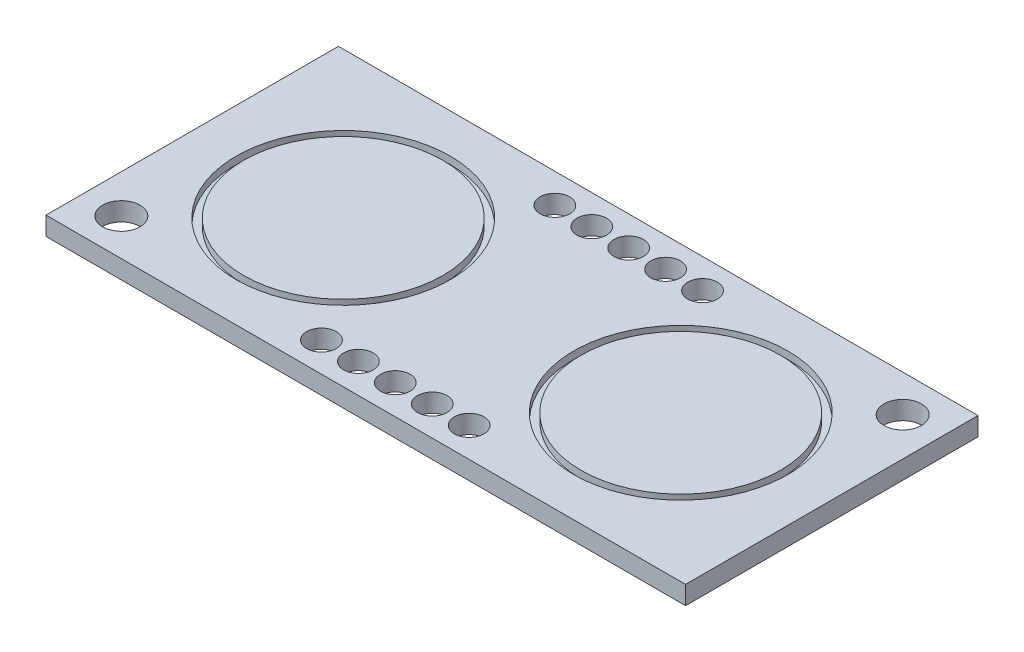
ISO-10303-21;
HEADER;
FILE_DESCRIPTION(('STEP AP214'),'2;1');
FILE_NAME('part.step','',(''),(''),'','','');
FILE_SCHEMA(('AUTOMOTIVE_DESIGN { 1 0 10303 214 1 1 1 1 }'));
ENDSEC;
DATA;
#1=APPLICATION_CONTEXT('core data for automotive mechanical design processes');
#2=APPLICATION_PROTOCOL_DEFINITION('international standard','automotive_design',2000,#1);
#3=PRODUCT_CONTEXT('',#1,'mechanical');
#4=PRODUCT('Part','Part','',(#3));
#5=PRODUCT_RELATED_PRODUCT_CATEGORY('part','',(#4));
#6=PRODUCT_DEFINITION_FORMATION('','',#4);
#7=PRODUCT_DEFINITION_CONTEXT('part definition',#1,'design');
#8=PRODUCT_DEFINITION('design','',#6,#7);
#9=PRODUCT_DEFINITION_SHAPE('','',#8);
#10=(LENGTH_UNIT() NAMED_UNIT(*) SI_UNIT(.MILLI.,.METRE.));
#11=(NAMED_UNIT(*) PLANE_ANGLE_UNIT() SI_UNIT($,.RADIAN.));
#12=(NAMED_UNIT(*) SI_UNIT($,.STERADIAN.) SOLID_ANGLE_UNIT());
#13=UNCERTAINTY_MEASURE_WITH_UNIT(LENGTH_MEASURE(1.E-05),#10,'distance_accuracy_value','');
#14=(GEOMETRIC_REPRESENTATION_CONTEXT(3) GLOBAL_UNCERTAINTY_ASSIGNED_CONTEXT((#13)) GLOBAL_UNIT_ASSIGNED_CONTEXT((#10,
#11,#12)) REPRESENTATION_CONTEXT('',''));
#15=CARTESIAN_POINT('',(0.,0.,0.));
#16=DIRECTION('',(0.,0.,1.));
#17=DIRECTION('',(1.,0.,0.));
#18=AXIS2_PLACEMENT_3D('',#15,#16,#17);
#19=CARTESIAN_POINT('',(-21.65,1.25,9.9));
#20=DIRECTION('',(0.,1.,0.));
#21=DIRECTION('',(0.,0.,1.));
#22=AXIS2_PLACEMENT_3D('',#19,#20,#21);
#23=PLANE('',#22);
#24=CARTESIAN_POINT('',(11.425,1.25,0.));
#25=DIRECTION('',(0.,1.,0.));
#26=DIRECTION('',(0.,0.,1.));
#27=AXIS2_PLACEMENT_3D('',#24,#25,#26);
#28=CIRCLE('',#27,7.25);
#29=CARTESIAN_POINT('',(11.425,1.25,7.25));
#30=VERTEX_POINT('',#29);
#31=EDGE_CURVE('E196',#30,#30,#28,.T.);
#32=ORIENTED_EDGE('',*,*,#31,.F.);
#33=EDGE_LOOP('',(#32));
#34=FACE_BOUND('',#33,.T.);
#35=CARTESIAN_POINT('',(-11.425,1.25,0.));
#36=DIRECTION('',(0.,1.,0.));
#37=DIRECTION('',(0.,0.,1.));
#38=AXIS2_PLACEMENT_3D('',#35,#36,#37);
#39=CIRCLE('',#38,7.25);
#40=CARTESIAN_POINT('',(-11.425,1.25,7.25));
#41=VERTEX_POINT('',#40);
#42=EDGE_CURVE('E184',#41,#41,#39,.T.);
#43=ORIENTED_EDGE('',*,*,#42,.F.);
#44=EDGE_LOOP('',(#43));
#45=FACE_BOUND('',#44,.T.);
#46=CARTESIAN_POINT('',(2.5,1.25,7.9));
#47=DIRECTION('',(0.,1.,0.));
#48=DIRECTION('',(0.,0.,1.));
#49=AXIS2_PLACEMENT_3D('',#46,#47,#48);
#50=CIRCLE('',#49,1.);
#51=CARTESIAN_POINT('',(2.5,1.25,8.9));
#52=VERTEX_POINT('',#51);
#53=EDGE_CURVE('E169',#52,#52,#50,.T.);
#54=ORIENTED_EDGE('',*,*,#53,.F.);
#55=EDGE_LOOP('',(#54));
#56=FACE_BOUND('',#55,.T.);
#57=CARTESIAN_POINT('',(-5.,1.25,7.9));
#58=DIRECTION('',(0.,1.,0.));
#59=DIRECTION('',(0.,0.,1.));
#60=AXIS2_PLACEMENT_3D('',#57,#58,#59);
#61=CIRCLE('',#60,1.);
#62=CARTESIAN_POINT('',(-5.,1.25,8.9));
#63=VERTEX_POINT('',#62);
#64=EDGE_CURVE('E157',#63,#63,#61,.T.);
#65=ORIENTED_EDGE('',*,*,#64,.F.);
#66=EDGE_LOOP('',(#65));
#67=FACE_BOUND('',#66,.T.);
#68=CARTESIAN_POINT('',(-2.5,1.25,-7.9));
#69=DIRECTION('',(0.,1.,0.));
#70=DIRECTION('',(0.,0.,1.));
#71=AXIS2_PLACEMENT_3D('',#68,#69,#70);
#72=CIRCLE('',#71,1.);
#73=CARTESIAN_POINT('',(-2.5,1.25,-6.9));
#74=VERTEX_POINT('',#73);
#75=EDGE_CURVE('E145',#74,#74,#72,.T.);
#76=ORIENTED_EDGE('',*,*,#75,.F.);
#77=EDGE_LOOP('',(#76));
#78=FACE_BOUND('',#77,.T.);
#79=CARTESIAN_POINT('',(2.5,1.25,-7.9));
#80=DIRECTION('',(0.,1.,0.));
#81=DIRECTION('',(0.,0.,1.));
#82=AXIS2_PLACEMENT_3D('',#79,#80,#81);
#83=CIRCLE('',#82,1.);
#84=CARTESIAN_POINT('',(2.5,1.25,-6.9));
#85=VERTEX_POINT('',#84);
#86=EDGE_CURVE('E133',#85,#85,#83,.T.);
#87=ORIENTED_EDGE('',*,*,#86,.F.);
#88=EDGE_LOOP('',(#87));
#89=FACE_BOUND('',#88,.T.);
#90=CARTESIAN_POINT('',(0.,1.25,7.9));
#91=DIRECTION('',(0.,1.,0.));
#92=DIRECTION('',(0.,0.,1.));
#93=AXIS2_PLACEMENT_3D('',#90,#91,#92);
#94=CIRCLE('',#93,1.);
#95=CARTESIAN_POINT('',(0.,1.25,8.9));
#96=VERTEX_POINT('',#95);
#97=EDGE_CURVE('E121',#96,#96,#94,.T.);
#98=ORIENTED_EDGE('',*,*,#97,.F.);
#99=EDGE_LOOP('',(#98));
#100=FACE_BOUND('',#99,.T.);
#101=CARTESIAN_POINT('',(-19.05,1.25,7.4));
#102=DIRECTION('',(0.,1.,0.));
#103=DIRECTION('',(0.,0.,1.));
#104=AXIS2_PLACEMENT_3D('',#101,#102,#103);
#105=CIRCLE('',#104,1.27);
#106=CARTESIAN_POINT('',(-19.05,1.25,8.67));
#107=VERTEX_POINT('',#106);
#108=EDGE_CURVE('E100',#107,#107,#105,.T.);
#109=ORIENTED_EDGE('',*,*,#108,.F.);
#110=EDGE_LOOP('',(#109));
#111=FACE_BOUND('',#110,.T.);
#112=DIRECTION('',(0.,0.,1.));
#113=VECTOR('',#112,1.);
#114=CARTESIAN_POINT('',(-21.65,1.25,-9.9));
#115=LINE('',#114,#113);
#116=CARTESIAN_POINT('',(-21.65,1.25,-9.9));
#117=VERTEX_POINT('',#116);
#118=CARTESIAN_POINT('',(-21.65,1.25,9.9));
#119=VERTEX_POINT('',#118);
#120=EDGE_CURVE('E85',#117,#119,#115,.T.);
#121=ORIENTED_EDGE('',*,*,#120,.T.);
#122=DIRECTION('',(1.,0.,0.));
#123=VECTOR('',#122,1.);
#124=CARTESIAN_POINT('',(-21.65,1.25,9.9));
#125=LINE('',#124,#123);
#126=CARTESIAN_POINT('',(21.65,1.25,9.9));
#127=VERTEX_POINT('',#126);
#128=EDGE_CURVE('E80',#119,#127,#125,.T.);
#129=ORIENTED_EDGE('',*,*,#128,.T.);
#130=DIRECTION('',(0.,0.,-1.));
#131=VECTOR('',#130,1.);
#132=CARTESIAN_POINT('',(21.65,1.25,-9.9));
#133=LINE('',#132,#131);
#134=CARTESIAN_POINT('',(21.65,1.25,-9.9));
#135=VERTEX_POINT('',#134);
#136=EDGE_CURVE('E83',#127,#135,#133,.T.);
#137=ORIENTED_EDGE('',*,*,#136,.T.);
#138=DIRECTION('',(-1.,0.,0.));
#139=VECTOR('',#138,1.);
#140=CARTESIAN_POINT('',(-21.65,1.25,-9.9));
#141=LINE('',#140,#139);
#142=EDGE_CURVE('E50',#135,#117,#141,.T.);
#143=ORIENTED_EDGE('',*,*,#142,.T.);
#144=EDGE_LOOP('',(#121,#129,#137,#143));
#145=FACE_BOUND('',#144,.T.);
#146=CARTESIAN_POINT('',(19.05,1.25,-7.40000000000009));
#147=DIRECTION('',(0.,1.,0.));
#148=DIRECTION('',(0.,0.,1.));
#149=AXIS2_PLACEMENT_3D('',#146,#147,#148);
#150=CIRCLE('',#149,1.26999999999997);
#151=CARTESIAN_POINT('',(19.05,1.25,-6.13000000000013));
#152=VERTEX_POINT('',#151);
#153=EDGE_CURVE('E115',#152,#152,#150,.T.);
#154=ORIENTED_EDGE('',*,*,#153,.F.);
#155=EDGE_LOOP('',(#154));
#156=FACE_BOUND('',#155,.T.);
#157=CARTESIAN_POINT('',(0.,1.25,-7.9));
#158=DIRECTION('',(0.,1.,0.));
#159=DIRECTION('',(0.,0.,1.));
#160=AXIS2_PLACEMENT_3D('',#157,#158,#159);
#161=CIRCLE('',#160,1.);
#162=CARTESIAN_POINT('',(0.,1.25,-6.9));
#163=VERTEX_POINT('',#162);
#164=EDGE_CURVE('E127',#163,#163,#161,.T.);
#165=ORIENTED_EDGE('',*,*,#164,.F.);
#166=EDGE_LOOP('',(#165));
#167=FACE_BOUND('',#166,.T.);
#168=CARTESIAN_POINT('',(5.,1.25,-7.9));
#169=DIRECTION('',(0.,1.,0.));
#170=DIRECTION('',(0.,0.,1.));
#171=AXIS2_PLACEMENT_3D('',#168,#169,#170);
#172=CIRCLE('',#171,1.);
#173=CARTESIAN_POINT('',(5.,1.25,-6.9));
#174=VERTEX_POINT('',#173);
#175=EDGE_CURVE('E139',#174,#174,#172,.T.);
#176=ORIENTED_EDGE('',*,*,#175,.F.);
#177=EDGE_LOOP('',(#176));
#178=FACE_BOUND('',#177,.T.);
#179=CARTESIAN_POINT('',(-5.,1.25,-7.9));
#180=DIRECTION('',(0.,1.,0.));
#181=DIRECTION('',(0.,0.,1.));
#182=AXIS2_PLACEMENT_3D('',#179,#180,#181);
#183=CIRCLE('',#182,1.);
#184=CARTESIAN_POINT('',(-5.,1.25,-6.9));
#185=VERTEX_POINT('',#184);
#186=EDGE_CURVE('E151',#185,#185,#183,.T.);
#187=ORIENTED_EDGE('',*,*,#186,.F.);
#188=EDGE_LOOP('',(#187));
#189=FACE_BOUND('',#188,.T.);
#190=CARTESIAN_POINT('',(-2.5,1.25,7.9));
#191=DIRECTION('',(0.,1.,0.));
#192=DIRECTION('',(0.,0.,1.));
#193=AXIS2_PLACEMENT_3D('',#190,#191,#192);
#194=CIRCLE('',#193,1.);
#195=CARTESIAN_POINT('',(-2.5,1.25,8.9));
#196=VERTEX_POINT('',#195);
#197=EDGE_CURVE('E163',#196,#196,#194,.T.);
#198=ORIENTED_EDGE('',*,*,#197,.F.);
#199=EDGE_LOOP('',(#198));
#200=FACE_BOUND('',#199,.T.);
#201=CARTESIAN_POINT('',(5.,1.25,7.9));
#202=DIRECTION('',(0.,1.,0.));
#203=DIRECTION('',(0.,0.,1.));
#204=AXIS2_PLACEMENT_3D('',#201,#202,#203);
#205=CIRCLE('',#204,1.);
#206=CARTESIAN_POINT('',(5.,1.25,8.9));
#207=VERTEX_POINT('',#206);
#208=EDGE_CURVE('E175',#207,#207,#205,.T.);
#209=ORIENTED_EDGE('',*,*,#208,.F.);
#210=EDGE_LOOP('',(#209));
#211=FACE_BOUND('',#210,.T.);
#212=ADVANCED_FACE('F33',(#34,#45,#56,#67,#78,#89,#100,#111,#145,#156,#167,#178,#189,#200,#211),
#23,.T.);
#213=CARTESIAN_POINT('',(-21.65,0.,9.9));
#214=DIRECTION('',(0.,1.,0.));
#215=DIRECTION('',(0.,0.,1.));
#216=AXIS2_PLACEMENT_3D('',#213,#214,#215);
#217=PLANE('',#216);
#218=CARTESIAN_POINT('',(2.5,0.,7.9));
#219=DIRECTION('',(0.,1.,0.));
#220=DIRECTION('',(0.,0.,1.));
#221=AXIS2_PLACEMENT_3D('',#218,#219,#220);
#222=CIRCLE('',#221,1.);
#223=CARTESIAN_POINT('',(2.5,0.,8.9));
#224=VERTEX_POINT('',#223);
#225=EDGE_CURVE('E172',#224,#224,#222,.T.);
#226=ORIENTED_EDGE('',*,*,#225,.T.);
#227=EDGE_LOOP('',(#226));
#228=FACE_BOUND('',#227,.T.);
#229=CARTESIAN_POINT('',(-5.,0.,7.9));
#230=DIRECTION('',(0.,1.,0.));
#231=DIRECTION('',(0.,0.,1.));
#232=AXIS2_PLACEMENT_3D('',#229,#230,#231);
#233=CIRCLE('',#232,1.);
#234=CARTESIAN_POINT('',(-5.,0.,8.9));
#235=VERTEX_POINT('',#234);
#236=EDGE_CURVE('E160',#235,#235,#233,.T.);
#237=ORIENTED_EDGE('',*,*,#236,.T.);
#238=EDGE_LOOP('',(#237));
#239=FACE_BOUND('',#238,.T.);
#240=CARTESIAN_POINT('',(-2.5,0.,-7.9));
#241=DIRECTION('',(0.,1.,0.));
#242=DIRECTION('',(0.,0.,1.));
#243=AXIS2_PLACEMENT_3D('',#240,#241,#242);
#244=CIRCLE('',#243,1.);
#245=CARTESIAN_POINT('',(-2.5,0.,-6.9));
#246=VERTEX_POINT('',#245);
#247=EDGE_CURVE('E148',#246,#246,#244,.T.);
#248=ORIENTED_EDGE('',*,*,#247,.T.);
#249=EDGE_LOOP('',(#248));
#250=FACE_BOUND('',#249,.T.);
#251=CARTESIAN_POINT('',(2.5,0.,-7.9));
#252=DIRECTION('',(0.,1.,0.));
#253=DIRECTION('',(0.,0.,1.));
#254=AXIS2_PLACEMENT_3D('',#251,#252,#253);
#255=CIRCLE('',#254,1.);
#256=CARTESIAN_POINT('',(2.5,0.,-6.9));
#257=VERTEX_POINT('',#256);
#258=EDGE_CURVE('E136',#257,#257,#255,.T.);
#259=ORIENTED_EDGE('',*,*,#258,.T.);
#260=EDGE_LOOP('',(#259));
#261=FACE_BOUND('',#260,.T.);
#262=CARTESIAN_POINT('',(0.,0.,7.9));
#263=DIRECTION('',(0.,1.,0.));
#264=DIRECTION('',(0.,0.,1.));
#265=AXIS2_PLACEMENT_3D('',#262,#263,#264);
#266=CIRCLE('',#265,1.);
#267=CARTESIAN_POINT('',(0.,0.,8.9));
#268=VERTEX_POINT('',#267);
#269=EDGE_CURVE('E124',#268,#268,#266,.T.);
#270=ORIENTED_EDGE('',*,*,#269,.T.);
#271=EDGE_LOOP('',(#270));
#272=FACE_BOUND('',#271,.T.);
#273=CARTESIAN_POINT('',(-19.05,0.,7.4));
#274=DIRECTION('',(0.,1.,0.));
#275=DIRECTION('',(0.,0.,1.));
#276=AXIS2_PLACEMENT_3D('',#273,#274,#275);
#277=CIRCLE('',#276,1.27);
#278=CARTESIAN_POINT('',(-19.05,0.,8.67));
#279=VERTEX_POINT('',#278);
#280=EDGE_CURVE('E112',#279,#279,#277,.T.);
#281=ORIENTED_EDGE('',*,*,#280,.T.);
#282=EDGE_LOOP('',(#281));
#283=FACE_BOUND('',#282,.T.);
#284=DIRECTION('',(0.,0.,1.));
#285=VECTOR('',#284,1.);
#286=CARTESIAN_POINT('',(-21.65,0.,-9.9));
#287=LINE('',#286,#285);
#288=CARTESIAN_POINT('',(-21.65,0.,-9.9));
#289=VERTEX_POINT('',#288);
#290=CARTESIAN_POINT('',(-21.65,0.,9.9));
#291=VERTEX_POINT('',#290);
#292=EDGE_CURVE('E97',#289,#291,#287,.T.);
#293=ORIENTED_EDGE('',*,*,#292,.F.);
#294=DIRECTION('',(-1.,0.,0.));
#295=VECTOR('',#294,1.);
#296=CARTESIAN_POINT('',(-21.65,0.,-9.9));
#297=LINE('',#296,#295);
#298=CARTESIAN_POINT('',(21.65,0.,-9.9));
#299=VERTEX_POINT('',#298);
#300=EDGE_CURVE('E73',#299,#289,#297,.T.);
#301=ORIENTED_EDGE('',*,*,#300,.F.);
#302=DIRECTION('',(0.,0.,-1.));
#303=VECTOR('',#302,1.);
#304=CARTESIAN_POINT('',(21.65,0.,-9.9));
#305=LINE('',#304,#303);
#306=CARTESIAN_POINT('',(21.65,0.,9.9));
#307=VERTEX_POINT('',#306);
#308=EDGE_CURVE('E67',#307,#299,#305,.T.);
#309=ORIENTED_EDGE('',*,*,#308,.F.);
#310=DIRECTION('',(1.,0.,0.));
#311=VECTOR('',#310,1.);
#312=CARTESIAN_POINT('',(-21.65,0.,9.9));
#313=LINE('',#312,#311);
#314=EDGE_CURVE('E89',#291,#307,#313,.T.);
#315=ORIENTED_EDGE('',*,*,#314,.F.);
#316=EDGE_LOOP('',(#293,#301,#309,#315));
#317=FACE_BOUND('',#316,.T.);
#318=CARTESIAN_POINT('',(19.05,0.,-7.40000000000009));
#319=DIRECTION('',(0.,1.,0.));
#320=DIRECTION('',(0.,0.,1.));
#321=AXIS2_PLACEMENT_3D('',#318,#319,#320);
#322=CIRCLE('',#321,1.26999999999997);
#323=CARTESIAN_POINT('',(19.05,0.,-6.13000000000013));
#324=VERTEX_POINT('',#323);
#325=EDGE_CURVE('E118',#324,#324,#322,.T.);
#326=ORIENTED_EDGE('',*,*,#325,.T.);
#327=EDGE_LOOP('',(#326));
#328=FACE_BOUND('',#327,.T.);
#329=CARTESIAN_POINT('',(0.,0.,-7.9));
#330=DIRECTION('',(0.,1.,0.));
#331=DIRECTION('',(0.,0.,1.));
#332=AXIS2_PLACEMENT_3D('',#329,#330,#331);
#333=CIRCLE('',#332,1.);
#334=CARTESIAN_POINT('',(0.,0.,-6.9));
#335=VERTEX_POINT('',#334);
#336=EDGE_CURVE('E130',#335,#335,#333,.T.);
#337=ORIENTED_EDGE('',*,*,#336,.T.);
#338=EDGE_LOOP('',(#337));
#339=FACE_BOUND('',#338,.T.);
#340=CARTESIAN_POINT('',(5.,0.,-7.9));
#341=DIRECTION('',(0.,1.,0.));
#342=DIRECTION('',(0.,0.,1.));
#343=AXIS2_PLACEMENT_3D('',#340,#341,#342);
#344=CIRCLE('',#343,1.);
#345=CARTESIAN_POINT('',(5.,0.,-6.9));
#346=VERTEX_POINT('',#345);
#347=EDGE_CURVE('E142',#346,#346,#344,.T.);
#348=ORIENTED_EDGE('',*,*,#347,.T.);
#349=EDGE_LOOP('',(#348));
#350=FACE_BOUND('',#349,.T.);
#351=CARTESIAN_POINT('',(-5.,0.,-7.9));
#352=DIRECTION('',(0.,1.,0.));
#353=DIRECTION('',(0.,0.,1.));
#354=AXIS2_PLACEMENT_3D('',#351,#352,#353);
#355=CIRCLE('',#354,1.);
#356=CARTESIAN_POINT('',(-5.,0.,-6.9));
#357=VERTEX_POINT('',#356);
#358=EDGE_CURVE('E154',#357,#357,#355,.T.);
#359=ORIENTED_EDGE('',*,*,#358,.T.);
#360=EDGE_LOOP('',(#359));
#361=FACE_BOUND('',#360,.T.);
#362=CARTESIAN_POINT('',(-2.5,0.,7.9));
#363=DIRECTION('',(0.,1.,0.));
#364=DIRECTION('',(0.,0.,1.));
#365=AXIS2_PLACEMENT_3D('',#362,#363,#364);
#366=CIRCLE('',#365,1.);
#367=CARTESIAN_POINT('',(-2.5,0.,8.9));
#368=VERTEX_POINT('',#367);
#369=EDGE_CURVE('E166',#368,#368,#366,.T.);
#370=ORIENTED_EDGE('',*,*,#369,.T.);
#371=EDGE_LOOP('',(#370));
#372=FACE_BOUND('',#371,.T.);
#373=CARTESIAN_POINT('',(5.,0.,7.9));
#374=DIRECTION('',(0.,1.,0.));
#375=DIRECTION('',(0.,0.,1.));
#376=AXIS2_PLACEMENT_3D('',#373,#374,#375);
#377=CIRCLE('',#376,1.);
#378=CARTESIAN_POINT('',(5.,0.,8.9));
#379=VERTEX_POINT('',#378);
#380=EDGE_CURVE('E178',#379,#379,#377,.T.);
#381=ORIENTED_EDGE('',*,*,#380,.T.);
#382=EDGE_LOOP('',(#381));
#383=FACE_BOUND('',#382,.T.);
#384=ADVANCED_FACE('F108',(#228,#239,#250,#261,#272,#283,#317,#328,#339,#350,#361,#372,#383),
#217,.F.);
#385=CARTESIAN_POINT('',(-21.65,1.25,-9.9));
#386=DIRECTION('',(1.,0.,0.));
#387=DIRECTION('',(0.,0.,-1.));
#388=AXIS2_PLACEMENT_3D('',#385,#386,#387);
#389=PLANE('',#388);
#390=ORIENTED_EDGE('',*,*,#292,.T.);
#391=DIRECTION('',(0.,-1.,0.));
#392=VECTOR('',#391,1.);
#393=CARTESIAN_POINT('',(-21.65,1.25,9.9));
#394=LINE('',#393,#392);
#395=EDGE_CURVE('E11',#119,#291,#394,.T.);
#396=ORIENTED_EDGE('',*,*,#395,.F.);
#397=ORIENTED_EDGE('',*,*,#120,.F.);
#398=DIRECTION('',(0.,-1.,0.));
#399=VECTOR('',#398,1.);
#400=CARTESIAN_POINT('',(-21.65,1.25,-9.9));
#401=LINE('',#400,#399);
#402=EDGE_CURVE('E93',#117,#289,#401,.T.);
#403=ORIENTED_EDGE('',*,*,#402,.T.);
#404=EDGE_LOOP('',(#390,#396,#397,#403));
#405=FACE_BOUND('',#404,.T.);
#406=ADVANCED_FACE('F35',(#405),#389,.F.);
#407=CARTESIAN_POINT('',(-21.65,1.25,9.9));
#408=DIRECTION('',(0.,0.,-1.));
#409=DIRECTION('',(-1.,0.,0.));
#410=AXIS2_PLACEMENT_3D('',#407,#408,#409);
#411=PLANE('',#410);
#412=ORIENTED_EDGE('',*,*,#314,.T.);
#413=DIRECTION('',(0.,-1.,0.));
#414=VECTOR('',#413,1.);
#415=CARTESIAN_POINT('',(21.65,1.25,9.9));
#416=LINE('',#415,#414);
#417=EDGE_CURVE('E42',#127,#307,#416,.T.);
#418=ORIENTED_EDGE('',*,*,#417,.F.);
#419=ORIENTED_EDGE('',*,*,#128,.F.);
#420=ORIENTED_EDGE('',*,*,#395,.T.);
#421=EDGE_LOOP('',(#412,#418,#419,#420));
#422=FACE_BOUND('',#421,.T.);
#423=ADVANCED_FACE('F88',(#422),#411,.F.);
#424=CARTESIAN_POINT('',(21.65,1.25,-9.9));
#425=DIRECTION('',(-1.,0.,0.));
#426=DIRECTION('',(0.,0.,1.));
#427=AXIS2_PLACEMENT_3D('',#424,#425,#426);
#428=PLANE('',#427);
#429=ORIENTED_EDGE('',*,*,#308,.T.);
#430=DIRECTION('',(0.,-1.,0.));
#431=VECTOR('',#430,1.);
#432=CARTESIAN_POINT('',(21.65,1.25,-9.9));
#433=LINE('',#432,#431);
#434=EDGE_CURVE('E90',#135,#299,#433,.T.);
#435=ORIENTED_EDGE('',*,*,#434,.F.);
#436=ORIENTED_EDGE('',*,*,#136,.F.);
#437=ORIENTED_EDGE('',*,*,#417,.T.);
#438=EDGE_LOOP('',(#429,#435,#436,#437));
#439=FACE_BOUND('',#438,.T.);
#440=ADVANCED_FACE('F91',(#439),#428,.F.);
#441=CARTESIAN_POINT('',(-21.65,1.25,-9.9));
#442=DIRECTION('',(0.,0.,1.));
#443=DIRECTION('',(1.,0.,0.));
#444=AXIS2_PLACEMENT_3D('',#441,#442,#443);
#445=PLANE('',#444);
#446=ORIENTED_EDGE('',*,*,#300,.T.);
#447=ORIENTED_EDGE('',*,*,#402,.F.);
#448=ORIENTED_EDGE('',*,*,#142,.F.);
#449=ORIENTED_EDGE('',*,*,#434,.T.);
#450=EDGE_LOOP('',(#446,#447,#448,#449));
#451=FACE_BOUND('',#450,.T.);
#452=ADVANCED_FACE('F105',(#451),#445,.F.);
#453=CARTESIAN_POINT('',(-19.05,1.25,7.4));
#454=DIRECTION('',(0.,-1.,0.));
#455=DIRECTION('',(0.,0.,-1.));
#456=AXIS2_PLACEMENT_3D('',#453,#454,#455);
#457=CYLINDRICAL_SURFACE('',#456,1.27);
#458=ORIENTED_EDGE('',*,*,#108,.T.);
#459=EDGE_LOOP('',(#458));
#460=FACE_BOUND('',#459,.T.);
#461=ORIENTED_EDGE('',*,*,#280,.F.);
#462=EDGE_LOOP('',(#461));
#463=FACE_BOUND('',#462,.T.);
#464=ADVANCED_FACE('F242',(#460,#463),#457,.F.);
#465=CARTESIAN_POINT('',(19.05,1.25,-7.40000000000009));
#466=DIRECTION('',(0.,-1.,0.));
#467=DIRECTION('',(0.,0.,-1.));
#468=AXIS2_PLACEMENT_3D('',#465,#466,#467);
#469=CYLINDRICAL_SURFACE('',#468,1.26999999999997);
#470=ORIENTED_EDGE('',*,*,#153,.T.);
#471=EDGE_LOOP('',(#470));
#472=FACE_BOUND('',#471,.T.);
#473=ORIENTED_EDGE('',*,*,#325,.F.);
#474=EDGE_LOOP('',(#473));
#475=FACE_BOUND('',#474,.T.);
#476=ADVANCED_FACE('F245',(#472,#475),#469,.F.);
#477=CARTESIAN_POINT('',(0.,1.25,7.9));
#478=DIRECTION('',(0.,-1.,0.));
#479=DIRECTION('',(0.,0.,-1.));
#480=AXIS2_PLACEMENT_3D('',#477,#478,#479);
#481=CYLINDRICAL_SURFACE('',#480,1.);
#482=ORIENTED_EDGE('',*,*,#97,.T.);
#483=EDGE_LOOP('',(#482));
#484=FACE_BOUND('',#483,.T.);
#485=ORIENTED_EDGE('',*,*,#269,.F.);
#486=EDGE_LOOP('',(#485));
#487=FACE_BOUND('',#486,.T.);
#488=ADVANCED_FACE('F283',(#484,#487),#481,.F.);
#489=CARTESIAN_POINT('',(0.,1.25,-7.9));
#490=DIRECTION('',(0.,-1.,0.));
#491=DIRECTION('',(0.,0.,-1.));
#492=AXIS2_PLACEMENT_3D('',#489,#490,#491);
#493=CYLINDRICAL_SURFACE('',#492,1.);
#494=ORIENTED_EDGE('',*,*,#164,.T.);
#495=EDGE_LOOP('',(#494));
#496=FACE_BOUND('',#495,.T.);
#497=ORIENTED_EDGE('',*,*,#336,.F.);
#498=EDGE_LOOP('',(#497));
#499=FACE_BOUND('',#498,.T.);
#500=ADVANCED_FACE('F291',(#496,#499),#493,.F.);
#501=CARTESIAN_POINT('',(2.5,1.25,-7.9));
#502=DIRECTION('',(0.,-1.,0.));
#503=DIRECTION('',(0.,0.,-1.));
#504=AXIS2_PLACEMENT_3D('',#501,#502,#503);
#505=CYLINDRICAL_SURFACE('',#504,1.);
#506=ORIENTED_EDGE('',*,*,#86,.T.);
#507=EDGE_LOOP('',(#506));
#508=FACE_BOUND('',#507,.T.);
#509=ORIENTED_EDGE('',*,*,#258,.F.);
#510=EDGE_LOOP('',(#509));
#511=FACE_BOUND('',#510,.T.);
#512=ADVANCED_FACE('F299',(#508,#511),#505,.F.);
#513=CARTESIAN_POINT('',(5.,1.25,-7.9));
#514=DIRECTION('',(0.,-1.,0.));
#515=DIRECTION('',(0.,0.,-1.));
#516=AXIS2_PLACEMENT_3D('',#513,#514,#515);
#517=CYLINDRICAL_SURFACE('',#516,1.);
#518=ORIENTED_EDGE('',*,*,#175,.T.);
#519=EDGE_LOOP('',(#518));
#520=FACE_BOUND('',#519,.T.);
#521=ORIENTED_EDGE('',*,*,#347,.F.);
#522=EDGE_LOOP('',(#521));
#523=FACE_BOUND('',#522,.T.);
#524=ADVANCED_FACE('F307',(#520,#523),#517,.F.);
#525=CARTESIAN_POINT('',(-2.5,1.25,-7.9));
#526=DIRECTION('',(0.,-1.,0.));
#527=DIRECTION('',(0.,0.,-1.));
#528=AXIS2_PLACEMENT_3D('',#525,#526,#527);
#529=CYLINDRICAL_SURFACE('',#528,1.);
#530=ORIENTED_EDGE('',*,*,#75,.T.);
#531=EDGE_LOOP('',(#530));
#532=FACE_BOUND('',#531,.T.);
#533=ORIENTED_EDGE('',*,*,#247,.F.);
#534=EDGE_LOOP('',(#533));
#535=FACE_BOUND('',#534,.T.);
#536=ADVANCED_FACE('F315',(#532,#535),#529,.F.);
#537=CARTESIAN_POINT('',(-5.,1.25,-7.9));
#538=DIRECTION('',(0.,-1.,0.));
#539=DIRECTION('',(0.,0.,-1.));
#540=AXIS2_PLACEMENT_3D('',#537,#538,#539);
#541=CYLINDRICAL_SURFACE('',#540,1.);
#542=ORIENTED_EDGE('',*,*,#186,.T.);
#543=EDGE_LOOP('',(#542));
#544=FACE_BOUND('',#543,.T.);
#545=ORIENTED_EDGE('',*,*,#358,.F.);
#546=EDGE_LOOP('',(#545));
#547=FACE_BOUND('',#546,.T.);
#548=ADVANCED_FACE('F323',(#544,#547),#541,.F.);
#549=CARTESIAN_POINT('',(-5.,1.25,7.9));
#550=DIRECTION('',(0.,-1.,0.));
#551=DIRECTION('',(0.,0.,-1.));
#552=AXIS2_PLACEMENT_3D('',#549,#550,#551);
#553=CYLINDRICAL_SURFACE('',#552,1.);
#554=ORIENTED_EDGE('',*,*,#64,.T.);
#555=EDGE_LOOP('',(#554));
#556=FACE_BOUND('',#555,.T.);
#557=ORIENTED_EDGE('',*,*,#236,.F.);
#558=EDGE_LOOP('',(#557));
#559=FACE_BOUND('',#558,.T.);
#560=ADVANCED_FACE('F331',(#556,#559),#553,.F.);
#561=CARTESIAN_POINT('',(-2.5,1.25,7.9));
#562=DIRECTION('',(0.,-1.,0.));
#563=DIRECTION('',(0.,0.,-1.));
#564=AXIS2_PLACEMENT_3D('',#561,#562,#563);
#565=CYLINDRICAL_SURFACE('',#564,1.);
#566=ORIENTED_EDGE('',*,*,#197,.T.);
#567=EDGE_LOOP('',(#566));
#568=FACE_BOUND('',#567,.T.);
#569=ORIENTED_EDGE('',*,*,#369,.F.);
#570=EDGE_LOOP('',(#569));
#571=FACE_BOUND('',#570,.T.);
#572=ADVANCED_FACE('F339',(#568,#571),#565,.F.);
#573=CARTESIAN_POINT('',(2.5,1.25,7.9));
#574=DIRECTION('',(0.,-1.,0.));
#575=DIRECTION('',(0.,0.,-1.));
#576=AXIS2_PLACEMENT_3D('',#573,#574,#575);
#577=CYLINDRICAL_SURFACE('',#576,1.);
#578=ORIENTED_EDGE('',*,*,#53,.T.);
#579=EDGE_LOOP('',(#578));
#580=FACE_BOUND('',#579,.T.);
#581=ORIENTED_EDGE('',*,*,#225,.F.);
#582=EDGE_LOOP('',(#581));
#583=FACE_BOUND('',#582,.T.);
#584=ADVANCED_FACE('F347',(#580,#583),#577,.F.);
#585=CARTESIAN_POINT('',(5.,1.25,7.9));
#586=DIRECTION('',(0.,-1.,0.));
#587=DIRECTION('',(0.,0.,-1.));
#588=AXIS2_PLACEMENT_3D('',#585,#586,#587);
#589=CYLINDRICAL_SURFACE('',#588,1.);
#590=ORIENTED_EDGE('',*,*,#208,.T.);
#591=EDGE_LOOP('',(#590));
#592=FACE_BOUND('',#591,.T.);
#593=ORIENTED_EDGE('',*,*,#380,.F.);
#594=EDGE_LOOP('',(#593));
#595=FACE_BOUND('',#594,.T.);
#596=ADVANCED_FACE('F355',(#592,#595),#589,.F.);
#597=CARTESIAN_POINT('',(-11.425,0.75,0.));
#598=DIRECTION('',(0.,1.,0.));
#599=DIRECTION('',(0.,0.,1.));
#600=AXIS2_PLACEMENT_3D('',#597,#598,#599);
#601=CYLINDRICAL_SURFACE('',#600,7.25);
#602=CARTESIAN_POINT('',(-11.425,0.75,0.));
#603=DIRECTION('',(0.,1.,0.));
#604=DIRECTION('',(0.,0.,1.));
#605=AXIS2_PLACEMENT_3D('',#602,#603,#604);
#606=CIRCLE('',#605,7.25);
#607=CARTESIAN_POINT('',(-11.425,0.75,7.25));
#608=VERTEX_POINT('',#607);
#609=EDGE_CURVE('E181',#608,#608,#606,.T.);
#610=ORIENTED_EDGE('',*,*,#609,.F.);
#611=EDGE_LOOP('',(#610));
#612=FACE_BOUND('',#611,.T.);
#613=ORIENTED_EDGE('',*,*,#42,.T.);
#614=EDGE_LOOP('',(#613));
#615=FACE_BOUND('',#614,.T.);
#616=ADVANCED_FACE('F363',(#612,#615),#601,.F.);
#617=CARTESIAN_POINT('',(-11.425,0.75,0.));
#618=DIRECTION('',(0.,1.,0.));
#619=DIRECTION('',(0.,0.,1.));
#620=AXIS2_PLACEMENT_3D('',#617,#618,#619);
#621=PLANE('',#620);
#622=CARTESIAN_POINT('',(-11.425,0.75,0.));
#623=DIRECTION('',(0.,1.,0.));
#624=DIRECTION('',(0.,0.,1.));
#625=AXIS2_PLACEMENT_3D('',#622,#623,#624);
#626=CIRCLE('',#625,6.75);
#627=CARTESIAN_POINT('',(-11.425,0.75,6.75));
#628=VERTEX_POINT('',#627);
#629=EDGE_CURVE('E187',#628,#628,#626,.T.);
#630=ORIENTED_EDGE('',*,*,#629,.F.);
#631=EDGE_LOOP('',(#630));
#632=FACE_BOUND('',#631,.T.);
#633=ORIENTED_EDGE('',*,*,#609,.T.);
#634=EDGE_LOOP('',(#633));
#635=FACE_BOUND('',#634,.T.);
#636=ADVANCED_FACE('F372',(#632,#635),#621,.T.);
#637=CARTESIAN_POINT('',(-11.425,0.75,0.));
#638=DIRECTION('',(0.,1.,0.));
#639=DIRECTION('',(0.,0.,1.));
#640=AXIS2_PLACEMENT_3D('',#637,#638,#639);
#641=CYLINDRICAL_SURFACE('',#640,6.75);
#642=ORIENTED_EDGE('',*,*,#629,.T.);
#643=EDGE_LOOP('',(#642));
#644=FACE_BOUND('',#643,.T.);
#645=CARTESIAN_POINT('',(-11.425,1.25,0.));
#646=DIRECTION('',(0.,1.,0.));
#647=DIRECTION('',(0.,0.,1.));
#648=AXIS2_PLACEMENT_3D('',#645,#646,#647);
#649=CIRCLE('',#648,6.75);
#650=CARTESIAN_POINT('',(-11.425,1.25,6.75));
#651=VERTEX_POINT('',#650);
#652=EDGE_CURVE('E190',#651,#651,#649,.T.);
#653=ORIENTED_EDGE('',*,*,#652,.F.);
#654=EDGE_LOOP('',(#653));
#655=FACE_BOUND('',#654,.T.);
#656=ADVANCED_FACE('F380',(#644,#655),#641,.T.);
#657=ORIENTED_EDGE('',*,*,#652,.T.);
#658=EDGE_LOOP('',(#657));
#659=FACE_BOUND('',#658,.T.);
#660=ADVANCED_FACE('F220',(#659),#23,.T.);
#661=CARTESIAN_POINT('',(11.425,0.75,0.));
#662=DIRECTION('',(0.,1.,0.));
#663=DIRECTION('',(0.,0.,1.));
#664=AXIS2_PLACEMENT_3D('',#661,#662,#663);
#665=CYLINDRICAL_SURFACE('',#664,7.25);
#666=CARTESIAN_POINT('',(11.425,0.75,0.));
#667=DIRECTION('',(0.,1.,0.));
#668=DIRECTION('',(0.,0.,1.));
#669=AXIS2_PLACEMENT_3D('',#666,#667,#668);
#670=CIRCLE('',#669,7.25);
#671=CARTESIAN_POINT('',(11.425,0.75,7.25));
#672=VERTEX_POINT('',#671);
#673=EDGE_CURVE('E193',#672,#672,#670,.T.);
#674=ORIENTED_EDGE('',*,*,#673,.F.);
#675=EDGE_LOOP('',(#674));
#676=FACE_BOUND('',#675,.T.);
#677=ORIENTED_EDGE('',*,*,#31,.T.);
#678=EDGE_LOOP('',(#677));
#679=FACE_BOUND('',#678,.T.);
#680=ADVANCED_FACE('F214',(#676,#679),#665,.F.);
#681=CARTESIAN_POINT('',(11.425,0.75,0.));
#682=DIRECTION('',(0.,1.,0.));
#683=DIRECTION('',(0.,0.,1.));
#684=AXIS2_PLACEMENT_3D('',#681,#682,#683);
#685=PLANE('',#684);
#686=CARTESIAN_POINT('',(11.425,0.75,0.));
#687=DIRECTION('',(0.,1.,0.));
#688=DIRECTION('',(0.,0.,1.));
#689=AXIS2_PLACEMENT_3D('',#686,#687,#688);
#690=CIRCLE('',#689,6.75);
#691=CARTESIAN_POINT('',(11.425,0.75,6.75));
#692=VERTEX_POINT('',#691);
#693=EDGE_CURVE('E199',#692,#692,#690,.T.);
#694=ORIENTED_EDGE('',*,*,#693,.F.);
#695=EDGE_LOOP('',(#694));
#696=FACE_BOUND('',#695,.T.);
#697=ORIENTED_EDGE('',*,*,#673,.T.);
#698=EDGE_LOOP('',(#697));
#699=FACE_BOUND('',#698,.T.);
#700=ADVANCED_FACE('F211',(#696,#699),#685,.T.);
#701=CARTESIAN_POINT('',(11.425,0.75,0.));
#702=DIRECTION('',(0.,1.,0.));
#703=DIRECTION('',(0.,0.,1.));
#704=AXIS2_PLACEMENT_3D('',#701,#702,#703);
#705=CYLINDRICAL_SURFACE('',#704,6.75);
#706=ORIENTED_EDGE('',*,*,#693,.T.);
#707=EDGE_LOOP('',(#706));
#708=FACE_BOUND('',#707,.T.);
#709=CARTESIAN_POINT('',(11.425,1.25,0.));
#710=DIRECTION('',(0.,1.,0.));
#711=DIRECTION('',(0.,0.,1.));
#712=AXIS2_PLACEMENT_3D('',#709,#710,#711);
#713=CIRCLE('',#712,6.75);
#714=CARTESIAN_POINT('',(11.425,1.25,6.75));
#715=VERTEX_POINT('',#714);
#716=EDGE_CURVE('E202',#715,#715,#713,.T.);
#717=ORIENTED_EDGE('',*,*,#716,.F.);
#718=EDGE_LOOP('',(#717));
#719=FACE_BOUND('',#718,.T.);
#720=ADVANCED_FACE('F208',(#708,#719),#705,.T.);
#721=ORIENTED_EDGE('',*,*,#716,.T.);
#722=EDGE_LOOP('',(#721));
#723=FACE_BOUND('',#722,.T.);
#724=ADVANCED_FACE('F227',(#723),#23,.T.);
#725=CLOSED_SHELL('',(#212,#384,#406,#423,#440,#452,#464,#476,#488,#500,#512,#524,#536,#548,
#560,#572,#584,#596,#616,#636,#656,#660,#680,#700,#720,#724));
#726=MANIFOLD_SOLID_BREP('B2',#725);
#727=ADVANCED_BREP_SHAPE_REPRESENTATION('',(#18,#726),#14);
#728=SHAPE_DEFINITION_REPRESENTATION(#9,#727);
ENDSEC;
END-ISO-10303-21;
